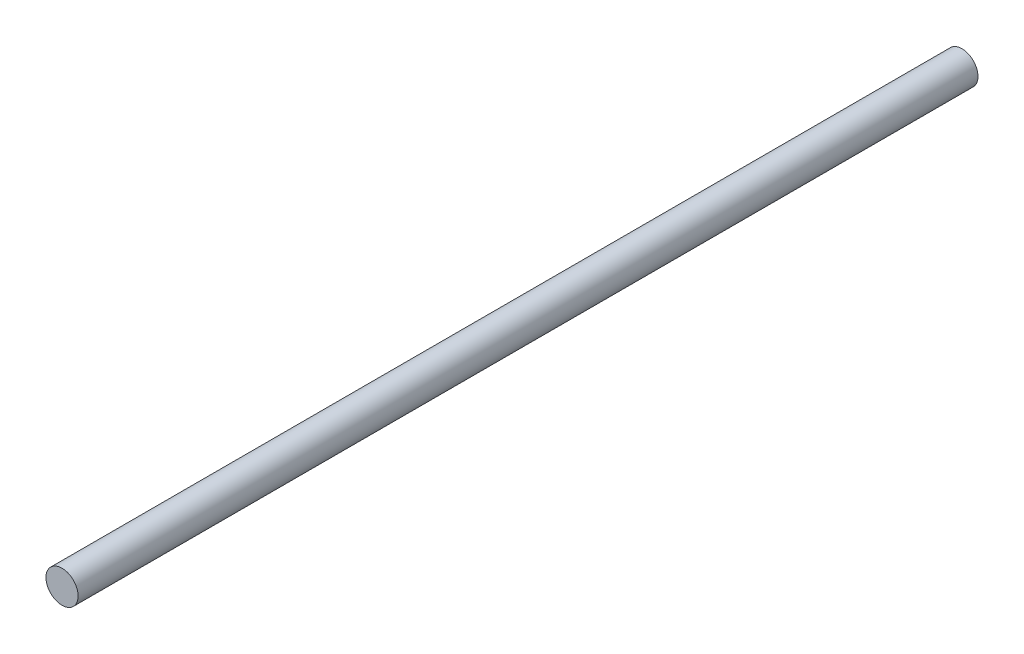
ISO-10303-21;
HEADER;
FILE_DESCRIPTION(('STEP AP214'),'2;1');
FILE_NAME('part.step','',(''),(''),'','','');
FILE_SCHEMA(('AUTOMOTIVE_DESIGN { 1 0 10303 214 1 1 1 1 }'));
ENDSEC;
DATA;
#1=APPLICATION_CONTEXT('core data for automotive mechanical design processes');
#2=APPLICATION_PROTOCOL_DEFINITION('international standard','automotive_design',2000,#1);
#3=PRODUCT_CONTEXT('',#1,'mechanical');
#4=PRODUCT('Part','Part','',(#3));
#5=PRODUCT_RELATED_PRODUCT_CATEGORY('part','',(#4));
#6=PRODUCT_DEFINITION_FORMATION('','',#4);
#7=PRODUCT_DEFINITION_CONTEXT('part definition',#1,'design');
#8=PRODUCT_DEFINITION('design','',#6,#7);
#9=PRODUCT_DEFINITION_SHAPE('','',#8);
#10=(LENGTH_UNIT() NAMED_UNIT(*) SI_UNIT(.MILLI.,.METRE.));
#11=(NAMED_UNIT(*) PLANE_ANGLE_UNIT() SI_UNIT($,.RADIAN.));
#12=(NAMED_UNIT(*) SI_UNIT($,.STERADIAN.) SOLID_ANGLE_UNIT());
#13=UNCERTAINTY_MEASURE_WITH_UNIT(LENGTH_MEASURE(1.E-05),#10,'distance_accuracy_value','');
#14=(GEOMETRIC_REPRESENTATION_CONTEXT(3) GLOBAL_UNCERTAINTY_ASSIGNED_CONTEXT((#13)) GLOBAL_UNIT_ASSIGNED_CONTEXT((#10,
#11,#12)) REPRESENTATION_CONTEXT('',''));
#15=CARTESIAN_POINT('',(0.,0.,0.));
#16=DIRECTION('',(0.,0.,1.));
#17=DIRECTION('',(1.,0.,0.));
#18=AXIS2_PLACEMENT_3D('',#15,#16,#17);
#19=CARTESIAN_POINT('',(0.,0.,140.));
#20=DIRECTION('',(0.,0.,-1.));
#21=DIRECTION('',(-1.,0.,0.));
#22=AXIS2_PLACEMENT_3D('',#19,#20,#21);
#23=CYLINDRICAL_SURFACE('',#22,2.5);
#24=CARTESIAN_POINT('',(0.,0.,140.));
#25=DIRECTION('',(0.,0.,1.));
#26=DIRECTION('',(1.,0.,0.));
#27=AXIS2_PLACEMENT_3D('',#24,#25,#26);
#28=CIRCLE('',#27,2.5);
#29=CARTESIAN_POINT('',(2.5,0.,140.));
#30=VERTEX_POINT('',#29);
#31=EDGE_CURVE('E10',#30,#30,#28,.T.);
#32=ORIENTED_EDGE('',*,*,#31,.F.);
#33=EDGE_LOOP('',(#32));
#34=FACE_BOUND('',#33,.T.);
#35=CARTESIAN_POINT('',(0.,0.,0.));
#36=DIRECTION('',(0.,0.,1.));
#37=DIRECTION('',(1.,0.,0.));
#38=AXIS2_PLACEMENT_3D('',#35,#36,#37);
#39=CIRCLE('',#38,2.5);
#40=CARTESIAN_POINT('',(2.5,0.,0.));
#41=VERTEX_POINT('',#40);
#42=EDGE_CURVE('E35',#41,#41,#39,.T.);
#43=ORIENTED_EDGE('',*,*,#42,.T.);
#44=EDGE_LOOP('',(#43));
#45=FACE_BOUND('',#44,.T.);
#46=ADVANCED_FACE('F32',(#34,#45),#23,.T.);
#47=CARTESIAN_POINT('',(0.,0.,140.));
#48=DIRECTION('',(0.,0.,1.));
#49=DIRECTION('',(1.,0.,0.));
#50=AXIS2_PLACEMENT_3D('',#47,#48,#49);
#51=PLANE('',#50);
#52=ORIENTED_EDGE('',*,*,#31,.T.);
#53=EDGE_LOOP('',(#52));
#54=FACE_BOUND('',#53,.T.);
#55=ADVANCED_FACE('F47',(#54),#51,.T.);
#56=CARTESIAN_POINT('',(0.,0.,0.));
#57=DIRECTION('',(0.,0.,1.));
#58=DIRECTION('',(1.,0.,0.));
#59=AXIS2_PLACEMENT_3D('',#56,#57,#58);
#60=PLANE('',#59);
#61=ORIENTED_EDGE('',*,*,#42,.F.);
#62=EDGE_LOOP('',(#61));
#63=FACE_BOUND('',#62,.T.);
#64=ADVANCED_FACE('F45',(#63),#60,.F.);
#65=CLOSED_SHELL('',(#46,#55,#64));
#66=MANIFOLD_SOLID_BREP('B2',#65);
#67=ADVANCED_BREP_SHAPE_REPRESENTATION('',(#18,#66),#14);
#68=SHAPE_DEFINITION_REPRESENTATION(#9,#67);
ENDSEC;
END-ISO-10303-21;
